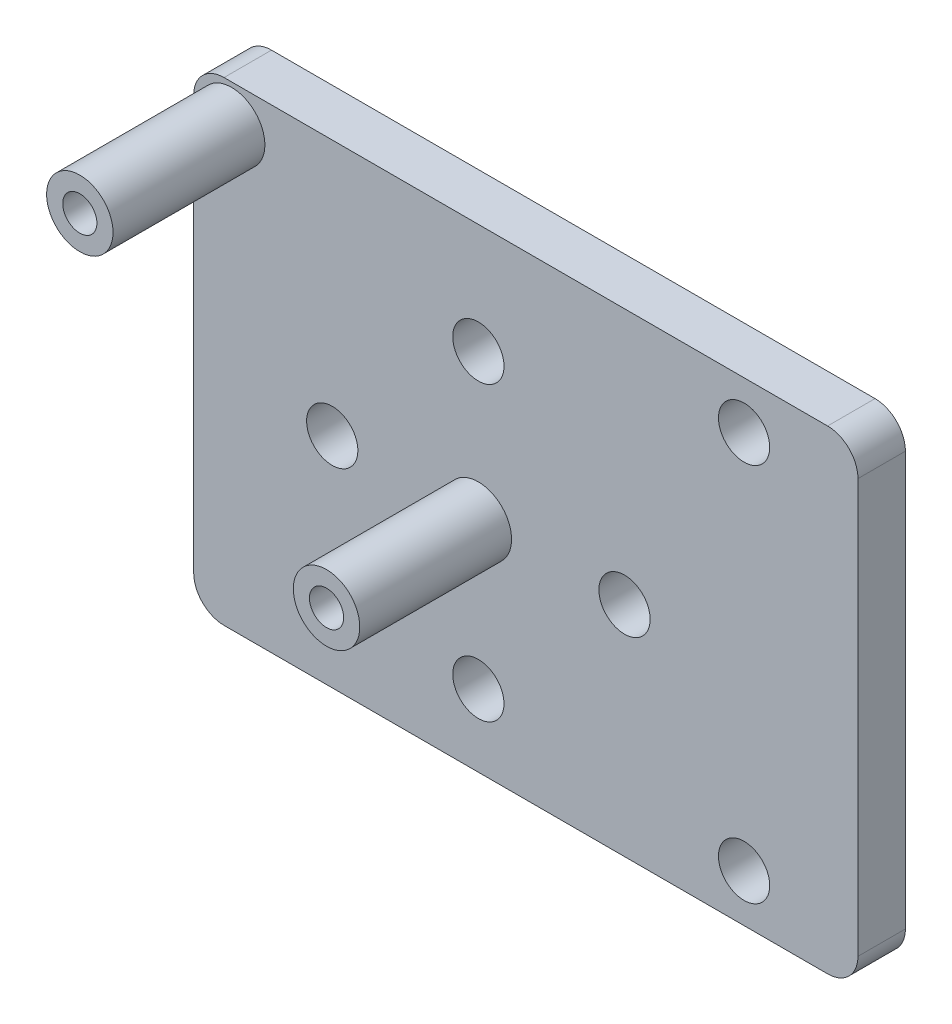
ISO-10303-21;
HEADER;
FILE_DESCRIPTION(('STEP AP214'),'2;1');
FILE_NAME('part.step','',(''),(''),'','','');
FILE_SCHEMA(('AUTOMOTIVE_DESIGN { 1 0 10303 214 1 1 1 1 }'));
ENDSEC;
DATA;
#1=APPLICATION_CONTEXT('core data for automotive mechanical design processes');
#2=APPLICATION_PROTOCOL_DEFINITION('international standard','automotive_design',2000,#1);
#3=PRODUCT_CONTEXT('',#1,'mechanical');
#4=PRODUCT('Part','Part','',(#3));
#5=PRODUCT_RELATED_PRODUCT_CATEGORY('part','',(#4));
#6=PRODUCT_DEFINITION_FORMATION('','',#4);
#7=PRODUCT_DEFINITION_CONTEXT('part definition',#1,'design');
#8=PRODUCT_DEFINITION('design','',#6,#7);
#9=PRODUCT_DEFINITION_SHAPE('','',#8);
#10=(LENGTH_UNIT() NAMED_UNIT(*) SI_UNIT(.MILLI.,.METRE.));
#11=(NAMED_UNIT(*) PLANE_ANGLE_UNIT() SI_UNIT($,.RADIAN.));
#12=(NAMED_UNIT(*) SI_UNIT($,.STERADIAN.) SOLID_ANGLE_UNIT());
#13=UNCERTAINTY_MEASURE_WITH_UNIT(LENGTH_MEASURE(1.E-05),#10,'distance_accuracy_value','');
#14=(GEOMETRIC_REPRESENTATION_CONTEXT(3) GLOBAL_UNCERTAINTY_ASSIGNED_CONTEXT((#13)) GLOBAL_UNIT_ASSIGNED_CONTEXT((#10,
#11,#12)) REPRESENTATION_CONTEXT('',''));
#15=CARTESIAN_POINT('',(0.,0.,0.));
#16=DIRECTION('',(0.,0.,1.));
#17=DIRECTION('',(1.,0.,0.));
#18=AXIS2_PLACEMENT_3D('',#15,#16,#17);
#19=CARTESIAN_POINT('',(0.,0.,3.175));
#20=DIRECTION('',(-1.,0.,0.));
#21=DIRECTION('',(0.,0.,1.));
#22=AXIS2_PLACEMENT_3D('',#19,#20,#21);
#23=PLANE('',#22);
#24=DIRECTION('',(0.,1.,0.));
#25=VECTOR('',#24,1.);
#26=CARTESIAN_POINT('',(0.,0.,0.));
#27=LINE('',#26,#25);
#28=CARTESIAN_POINT('',(0.,-29.718,0.));
#29=VERTEX_POINT('',#28);
#30=CARTESIAN_POINT('',(0.,-2.032,0.));
#31=VERTEX_POINT('',#30);
#32=EDGE_CURVE('E130',#29,#31,#27,.T.);
#33=ORIENTED_EDGE('',*,*,#32,.T.);
#34=DIRECTION('',(0.,0.,-1.));
#35=VECTOR('',#34,1.);
#36=CARTESIAN_POINT('',(0.,-2.032,3.175));
#37=LINE('',#36,#35);
#38=CARTESIAN_POINT('',(0.,-2.032,3.175));
#39=VERTEX_POINT('',#38);
#40=EDGE_CURVE('E11',#31,#39,#37,.F.);
#41=ORIENTED_EDGE('',*,*,#40,.T.);
#42=DIRECTION('',(0.,1.,0.));
#43=VECTOR('',#42,1.);
#44=CARTESIAN_POINT('',(0.,0.,3.175));
#45=LINE('',#44,#43);
#46=CARTESIAN_POINT('',(0.,-29.718,3.175));
#47=VERTEX_POINT('',#46);
#48=EDGE_CURVE('E128',#47,#39,#45,.T.);
#49=ORIENTED_EDGE('',*,*,#48,.F.);
#50=DIRECTION('',(0.,0.,-1.));
#51=VECTOR('',#50,1.);
#52=CARTESIAN_POINT('',(0.,-29.718,3.175));
#53=LINE('',#52,#51);
#54=EDGE_CURVE('E42',#47,#29,#53,.T.);
#55=ORIENTED_EDGE('',*,*,#54,.T.);
#56=EDGE_LOOP('',(#33,#41,#49,#55));
#57=FACE_BOUND('',#56,.T.);
#58=ADVANCED_FACE('F34',(#57),#23,.F.);
#59=CARTESIAN_POINT('',(0.,0.,3.175));
#60=DIRECTION('',(0.,-1.,0.));
#61=DIRECTION('',(1.,0.,0.));
#62=AXIS2_PLACEMENT_3D('',#59,#60,#61);
#63=PLANE('',#62);
#64=DIRECTION('',(-1.,0.,0.));
#65=VECTOR('',#64,1.);
#66=CARTESIAN_POINT('',(0.,0.,0.));
#67=LINE('',#66,#65);
#68=CARTESIAN_POINT('',(-2.032,0.,0.));
#69=VERTEX_POINT('',#68);
#70=CARTESIAN_POINT('',(-42.418,0.,0.));
#71=VERTEX_POINT('',#70);
#72=EDGE_CURVE('E126',#69,#71,#67,.T.);
#73=ORIENTED_EDGE('',*,*,#72,.T.);
#74=DIRECTION('',(0.,0.,-1.));
#75=VECTOR('',#74,1.);
#76=CARTESIAN_POINT('',(-42.418,0.,3.175));
#77=LINE('',#76,#75);
#78=CARTESIAN_POINT('',(-42.418,0.,3.175));
#79=VERTEX_POINT('',#78);
#80=EDGE_CURVE('E105',#71,#79,#77,.F.);
#81=ORIENTED_EDGE('',*,*,#80,.T.);
#82=DIRECTION('',(-1.,0.,0.));
#83=VECTOR('',#82,1.);
#84=CARTESIAN_POINT('',(0.,0.,3.175));
#85=LINE('',#84,#83);
#86=CARTESIAN_POINT('',(-2.032,0.,3.175));
#87=VERTEX_POINT('',#86);
#88=EDGE_CURVE('E199',#87,#79,#85,.T.);
#89=ORIENTED_EDGE('',*,*,#88,.F.);
#90=DIRECTION('',(0.,0.,-1.));
#91=VECTOR('',#90,1.);
#92=CARTESIAN_POINT('',(-2.032,0.,3.175));
#93=LINE('',#92,#91);
#94=EDGE_CURVE('E110',#87,#69,#93,.T.);
#95=ORIENTED_EDGE('',*,*,#94,.T.);
#96=EDGE_LOOP('',(#73,#81,#89,#95));
#97=FACE_BOUND('',#96,.T.);
#98=ADVANCED_FACE('F257',(#97),#63,.F.);
#99=CARTESIAN_POINT('',(-44.45,0.,3.175));
#100=DIRECTION('',(1.,0.,0.));
#101=DIRECTION('',(0.,1.,0.));
#102=AXIS2_PLACEMENT_3D('',#99,#100,#101);
#103=PLANE('',#102);
#104=DIRECTION('',(0.,-1.,0.));
#105=VECTOR('',#104,1.);
#106=CARTESIAN_POINT('',(-44.45,0.,3.175));
#107=LINE('',#106,#105);
#108=CARTESIAN_POINT('',(-44.45,-2.032,3.175));
#109=VERTEX_POINT('',#108);
#110=CARTESIAN_POINT('',(-44.45,-29.718,3.175));
#111=VERTEX_POINT('',#110);
#112=EDGE_CURVE('E119',#109,#111,#107,.T.);
#113=ORIENTED_EDGE('',*,*,#112,.F.);
#114=DIRECTION('',(0.,0.,-1.));
#115=VECTOR('',#114,1.);
#116=CARTESIAN_POINT('',(-44.45,-2.03200000000001,3.175));
#117=LINE('',#116,#115);
#118=CARTESIAN_POINT('',(-44.45,-2.032,0.));
#119=VERTEX_POINT('',#118);
#120=EDGE_CURVE('E104',#109,#119,#117,.T.);
#121=ORIENTED_EDGE('',*,*,#120,.T.);
#122=DIRECTION('',(0.,-1.,0.));
#123=VECTOR('',#122,1.);
#124=CARTESIAN_POINT('',(-44.45,0.,0.));
#125=LINE('',#124,#123);
#126=CARTESIAN_POINT('',(-44.45,-29.718,0.));
#127=VERTEX_POINT('',#126);
#128=EDGE_CURVE('E117',#119,#127,#125,.T.);
#129=ORIENTED_EDGE('',*,*,#128,.T.);
#130=DIRECTION('',(0.,0.,-1.));
#131=VECTOR('',#130,1.);
#132=CARTESIAN_POINT('',(-44.45,-29.718,3.175));
#133=LINE('',#132,#131);
#134=EDGE_CURVE('E121',#127,#111,#133,.F.);
#135=ORIENTED_EDGE('',*,*,#134,.T.);
#136=EDGE_LOOP('',(#113,#121,#129,#135));
#137=FACE_BOUND('',#136,.T.);
#138=ADVANCED_FACE('F116',(#137),#103,.F.);
#139=CARTESIAN_POINT('',(0.,-31.75,3.175));
#140=DIRECTION('',(0.,1.,0.));
#141=DIRECTION('',(-1.,0.,0.));
#142=AXIS2_PLACEMENT_3D('',#139,#140,#141);
#143=PLANE('',#142);
#144=DIRECTION('',(1.,0.,0.));
#145=VECTOR('',#144,1.);
#146=CARTESIAN_POINT('',(0.,-31.75,3.175));
#147=LINE('',#146,#145);
#148=CARTESIAN_POINT('',(-42.418,-31.75,3.175));
#149=VERTEX_POINT('',#148);
#150=CARTESIAN_POINT('',(-2.032,-31.75,3.175));
#151=VERTEX_POINT('',#150);
#152=EDGE_CURVE('E138',#149,#151,#147,.T.);
#153=ORIENTED_EDGE('',*,*,#152,.F.);
#154=DIRECTION('',(0.,0.,-1.));
#155=VECTOR('',#154,1.);
#156=CARTESIAN_POINT('',(-42.418,-31.75,3.175));
#157=LINE('',#156,#155);
#158=CARTESIAN_POINT('',(-42.418,-31.75,0.));
#159=VERTEX_POINT('',#158);
#160=EDGE_CURVE('E180',#149,#159,#157,.T.);
#161=ORIENTED_EDGE('',*,*,#160,.T.);
#162=DIRECTION('',(1.,0.,0.));
#163=VECTOR('',#162,1.);
#164=CARTESIAN_POINT('',(0.,-31.75,0.));
#165=LINE('',#164,#163);
#166=CARTESIAN_POINT('',(-2.032,-31.75,0.));
#167=VERTEX_POINT('',#166);
#168=EDGE_CURVE('E125',#159,#167,#165,.T.);
#169=ORIENTED_EDGE('',*,*,#168,.T.);
#170=DIRECTION('',(0.,0.,-1.));
#171=VECTOR('',#170,1.);
#172=CARTESIAN_POINT('',(-2.032,-31.75,3.175));
#173=LINE('',#172,#171);
#174=EDGE_CURVE('E49',#167,#151,#173,.F.);
#175=ORIENTED_EDGE('',*,*,#174,.T.);
#176=EDGE_LOOP('',(#153,#161,#169,#175));
#177=FACE_BOUND('',#176,.T.);
#178=ADVANCED_FACE('F236',(#177),#143,.F.);
#179=CARTESIAN_POINT('',(0.,0.,3.175));
#180=DIRECTION('',(0.,0.,-1.));
#181=DIRECTION('',(-1.,0.,0.));
#182=AXIS2_PLACEMENT_3D('',#179,#180,#181);
#183=PLANE('',#182);
#184=CARTESIAN_POINT('',(-35.179,-17.145,3.175));
#185=DIRECTION('',(0.,0.,1.));
#186=DIRECTION('',(0.,1.,0.));
#187=AXIS2_PLACEMENT_3D('',#184,#185,#186);
#188=CIRCLE('',#187,1.7145);
#189=CARTESIAN_POINT('',(-35.179,-15.4305,3.175));
#190=VERTEX_POINT('',#189);
#191=EDGE_CURVE('E158',#190,#190,#188,.T.);
#192=ORIENTED_EDGE('',*,*,#191,.F.);
#193=EDGE_LOOP('',(#192));
#194=FACE_BOUND('',#193,.T.);
#195=CARTESIAN_POINT('',(-25.4,-26.924,3.175));
#196=DIRECTION('',(0.,0.,1.));
#197=DIRECTION('',(-1.,0.,0.));
#198=AXIS2_PLACEMENT_3D('',#195,#196,#197);
#199=CIRCLE('',#198,1.7145);
#200=CARTESIAN_POINT('',(-27.1145,-26.924,3.175));
#201=VERTEX_POINT('',#200);
#202=EDGE_CURVE('E225',#201,#201,#199,.T.);
#203=ORIENTED_EDGE('',*,*,#202,.F.);
#204=EDGE_LOOP('',(#203));
#205=FACE_BOUND('',#204,.T.);
#206=CARTESIAN_POINT('',(-15.621,-17.1449999999999,3.175));
#207=DIRECTION('',(0.,0.,1.));
#208=DIRECTION('',(0.,-1.,0.));
#209=AXIS2_PLACEMENT_3D('',#206,#207,#208);
#210=CIRCLE('',#209,1.7145);
#211=CARTESIAN_POINT('',(-15.621,-18.8594999999999,3.175));
#212=VERTEX_POINT('',#211);
#213=EDGE_CURVE('E222',#212,#212,#210,.T.);
#214=ORIENTED_EDGE('',*,*,#213,.F.);
#215=EDGE_LOOP('',(#214));
#216=FACE_BOUND('',#215,.T.);
#217=CARTESIAN_POINT('',(-25.4,-7.366,3.175));
#218=DIRECTION('',(0.,0.,1.));
#219=DIRECTION('',(1.,0.,0.));
#220=AXIS2_PLACEMENT_3D('',#217,#218,#219);
#221=CIRCLE('',#220,1.7145);
#222=CARTESIAN_POINT('',(-23.6855,-7.366,3.175));
#223=VERTEX_POINT('',#222);
#224=EDGE_CURVE('E153',#223,#223,#221,.T.);
#225=ORIENTED_EDGE('',*,*,#224,.F.);
#226=EDGE_LOOP('',(#225));
#227=FACE_BOUND('',#226,.T.);
#228=CARTESIAN_POINT('',(-7.62,-3.17499999999999,3.175));
#229=DIRECTION('',(0.,0.,1.));
#230=DIRECTION('',(1.,0.,0.));
#231=AXIS2_PLACEMENT_3D('',#228,#229,#230);
#232=CIRCLE('',#231,1.7145);
#233=CARTESIAN_POINT('',(-5.9055,-3.17499999999999,3.175));
#234=VERTEX_POINT('',#233);
#235=EDGE_CURVE('E145',#234,#234,#232,.T.);
#236=ORIENTED_EDGE('',*,*,#235,.F.);
#237=EDGE_LOOP('',(#236));
#238=FACE_BOUND('',#237,.T.);
#239=CARTESIAN_POINT('',(-7.62,-28.575,3.175));
#240=DIRECTION('',(0.,0.,1.));
#241=DIRECTION('',(1.,0.,0.));
#242=AXIS2_PLACEMENT_3D('',#239,#240,#241);
#243=CIRCLE('',#242,1.7145);
#244=CARTESIAN_POINT('',(-5.9055,-28.575,3.175));
#245=VERTEX_POINT('',#244);
#246=EDGE_CURVE('E152',#245,#245,#243,.T.);
#247=ORIENTED_EDGE('',*,*,#246,.F.);
#248=EDGE_LOOP('',(#247));
#249=FACE_BOUND('',#248,.T.);
#250=CARTESIAN_POINT('',(-25.4,-17.145,3.175));
#251=DIRECTION('',(0.,0.,-1.));
#252=DIRECTION('',(-1.,0.,0.));
#253=AXIS2_PLACEMENT_3D('',#250,#251,#252);
#254=CIRCLE('',#253,2.2225);
#255=CARTESIAN_POINT('',(-27.6225,-17.145,3.175));
#256=VERTEX_POINT('',#255);
#257=EDGE_CURVE('E137',#256,#256,#254,.F.);
#258=ORIENTED_EDGE('',*,*,#257,.F.);
#259=EDGE_LOOP('',(#258));
#260=FACE_BOUND('',#259,.T.);
#261=CARTESIAN_POINT('',(-41.91,-2.54,3.175));
#262=DIRECTION('',(0.,0.,-1.));
#263=DIRECTION('',(-1.,0.,0.));
#264=AXIS2_PLACEMENT_3D('',#261,#262,#263);
#265=CIRCLE('',#264,2.2225);
#266=CARTESIAN_POINT('',(-44.1325,-2.54,3.175));
#267=VERTEX_POINT('',#266);
#268=EDGE_CURVE('E134',#267,#267,#265,.F.);
#269=ORIENTED_EDGE('',*,*,#268,.F.);
#270=EDGE_LOOP('',(#269));
#271=FACE_BOUND('',#270,.T.);
#272=ORIENTED_EDGE('',*,*,#88,.T.);
#273=CARTESIAN_POINT('',(-42.418,-2.03200000000001,3.175));
#274=DIRECTION('',(0.,0.,-1.));
#275=DIRECTION('',(-1.,0.,0.));
#276=AXIS2_PLACEMENT_3D('',#273,#274,#275);
#277=CIRCLE('',#276,2.032);
#278=EDGE_CURVE('E177',#79,#109,#277,.F.);
#279=ORIENTED_EDGE('',*,*,#278,.T.);
#280=ORIENTED_EDGE('',*,*,#112,.T.);
#281=CARTESIAN_POINT('',(-42.418,-29.718,3.175));
#282=DIRECTION('',(0.,0.,-1.));
#283=DIRECTION('',(-1.,0.,0.));
#284=AXIS2_PLACEMENT_3D('',#281,#282,#283);
#285=CIRCLE('',#284,2.032);
#286=EDGE_CURVE('E56',#111,#149,#285,.F.);
#287=ORIENTED_EDGE('',*,*,#286,.T.);
#288=ORIENTED_EDGE('',*,*,#152,.T.);
#289=CARTESIAN_POINT('',(-2.032,-29.718,3.175));
#290=DIRECTION('',(0.,0.,-1.));
#291=DIRECTION('',(-1.,0.,0.));
#292=AXIS2_PLACEMENT_3D('',#289,#290,#291);
#293=CIRCLE('',#292,2.032);
#294=EDGE_CURVE('E172',#151,#47,#293,.F.);
#295=ORIENTED_EDGE('',*,*,#294,.T.);
#296=ORIENTED_EDGE('',*,*,#48,.T.);
#297=CARTESIAN_POINT('',(-2.032,-2.032,3.175));
#298=DIRECTION('',(0.,0.,-1.));
#299=DIRECTION('',(-1.,0.,0.));
#300=AXIS2_PLACEMENT_3D('',#297,#298,#299);
#301=CIRCLE('',#300,2.032);
#302=EDGE_CURVE('E174',#39,#87,#301,.F.);
#303=ORIENTED_EDGE('',*,*,#302,.T.);
#304=EDGE_LOOP('',(#272,#279,#280,#287,#288,#295,#296,#303));
#305=FACE_BOUND('',#304,.T.);
#306=ADVANCED_FACE('F233',(#194,#205,#216,#227,#238,#249,#260,#271,#305),#183,.F.);
#307=CARTESIAN_POINT('',(0.,0.,0.));
#308=DIRECTION('',(0.,0.,-1.));
#309=DIRECTION('',(-1.,0.,0.));
#310=AXIS2_PLACEMENT_3D('',#307,#308,#309);
#311=PLANE('',#310);
#312=CARTESIAN_POINT('',(-35.179,-17.145,0.));
#313=DIRECTION('',(0.,0.,-1.));
#314=DIRECTION('',(-1.,0.,0.));
#315=AXIS2_PLACEMENT_3D('',#312,#313,#314);
#316=CIRCLE('',#315,1.7145);
#317=CARTESIAN_POINT('',(-36.8935,-17.145,0.));
#318=VERTEX_POINT('',#317);
#319=EDGE_CURVE('E161',#318,#318,#316,.T.);
#320=ORIENTED_EDGE('',*,*,#319,.F.);
#321=EDGE_LOOP('',(#320));
#322=FACE_BOUND('',#321,.T.);
#323=CARTESIAN_POINT('',(-25.4,-26.924,0.));
#324=DIRECTION('',(0.,0.,-1.));
#325=DIRECTION('',(-1.,0.,0.));
#326=AXIS2_PLACEMENT_3D('',#323,#324,#325);
#327=CIRCLE('',#326,1.7145);
#328=CARTESIAN_POINT('',(-27.1145,-26.924,0.));
#329=VERTEX_POINT('',#328);
#330=EDGE_CURVE('E157',#329,#329,#327,.T.);
#331=ORIENTED_EDGE('',*,*,#330,.F.);
#332=EDGE_LOOP('',(#331));
#333=FACE_BOUND('',#332,.T.);
#334=CARTESIAN_POINT('',(-15.621,-17.1449999999999,0.));
#335=DIRECTION('',(0.,0.,-1.));
#336=DIRECTION('',(-1.,0.,0.));
#337=AXIS2_PLACEMENT_3D('',#334,#335,#336);
#338=CIRCLE('',#337,1.7145);
#339=CARTESIAN_POINT('',(-17.3355,-17.1449999999999,0.));
#340=VERTEX_POINT('',#339);
#341=EDGE_CURVE('E154',#340,#340,#338,.T.);
#342=ORIENTED_EDGE('',*,*,#341,.F.);
#343=EDGE_LOOP('',(#342));
#344=FACE_BOUND('',#343,.T.);
#345=CARTESIAN_POINT('',(-25.4,-7.366,0.));
#346=DIRECTION('',(0.,0.,-1.));
#347=DIRECTION('',(-1.,0.,0.));
#348=AXIS2_PLACEMENT_3D('',#345,#346,#347);
#349=CIRCLE('',#348,1.7145);
#350=CARTESIAN_POINT('',(-27.1145,-7.366,0.));
#351=VERTEX_POINT('',#350);
#352=EDGE_CURVE('E149',#351,#351,#349,.T.);
#353=ORIENTED_EDGE('',*,*,#352,.F.);
#354=EDGE_LOOP('',(#353));
#355=FACE_BOUND('',#354,.T.);
#356=CARTESIAN_POINT('',(-7.62,-3.17499999999999,0.));
#357=DIRECTION('',(0.,0.,-1.));
#358=DIRECTION('',(-1.,0.,0.));
#359=AXIS2_PLACEMENT_3D('',#356,#357,#358);
#360=CIRCLE('',#359,1.7145);
#361=CARTESIAN_POINT('',(-9.3345,-3.17499999999999,0.));
#362=VERTEX_POINT('',#361);
#363=EDGE_CURVE('E144',#362,#362,#360,.T.);
#364=ORIENTED_EDGE('',*,*,#363,.F.);
#365=EDGE_LOOP('',(#364));
#366=FACE_BOUND('',#365,.T.);
#367=CARTESIAN_POINT('',(-7.62,-28.575,0.));
#368=DIRECTION('',(0.,0.,-1.));
#369=DIRECTION('',(-1.,0.,0.));
#370=AXIS2_PLACEMENT_3D('',#367,#368,#369);
#371=CIRCLE('',#370,1.7145);
#372=CARTESIAN_POINT('',(-9.3345,-28.575,0.));
#373=VERTEX_POINT('',#372);
#374=EDGE_CURVE('E141',#373,#373,#371,.T.);
#375=ORIENTED_EDGE('',*,*,#374,.F.);
#376=EDGE_LOOP('',(#375));
#377=FACE_BOUND('',#376,.T.);
#378=ORIENTED_EDGE('',*,*,#128,.F.);
#379=CARTESIAN_POINT('',(-42.418,-2.03200000000001,0.));
#380=DIRECTION('',(0.,0.,-1.));
#381=DIRECTION('',(-1.,0.,0.));
#382=AXIS2_PLACEMENT_3D('',#379,#380,#381);
#383=CIRCLE('',#382,2.032);
#384=EDGE_CURVE('E100',#119,#71,#383,.T.);
#385=ORIENTED_EDGE('',*,*,#384,.T.);
#386=ORIENTED_EDGE('',*,*,#72,.F.);
#387=CARTESIAN_POINT('',(-2.032,-2.032,0.));
#388=DIRECTION('',(0.,0.,-1.));
#389=DIRECTION('',(-1.,0.,0.));
#390=AXIS2_PLACEMENT_3D('',#387,#388,#389);
#391=CIRCLE('',#390,2.032);
#392=EDGE_CURVE('E166',#69,#31,#391,.T.);
#393=ORIENTED_EDGE('',*,*,#392,.T.);
#394=ORIENTED_EDGE('',*,*,#32,.F.);
#395=CARTESIAN_POINT('',(-2.032,-29.718,0.));
#396=DIRECTION('',(0.,0.,-1.));
#397=DIRECTION('',(-1.,0.,0.));
#398=AXIS2_PLACEMENT_3D('',#395,#396,#397);
#399=CIRCLE('',#398,2.032);
#400=EDGE_CURVE('E120',#29,#167,#399,.T.);
#401=ORIENTED_EDGE('',*,*,#400,.T.);
#402=ORIENTED_EDGE('',*,*,#168,.F.);
#403=CARTESIAN_POINT('',(-42.418,-29.718,0.));
#404=DIRECTION('',(0.,0.,-1.));
#405=DIRECTION('',(-1.,0.,0.));
#406=AXIS2_PLACEMENT_3D('',#403,#404,#405);
#407=CIRCLE('',#406,2.032);
#408=EDGE_CURVE('E111',#159,#127,#407,.T.);
#409=ORIENTED_EDGE('',*,*,#408,.T.);
#410=EDGE_LOOP('',(#378,#385,#386,#393,#394,#401,#402,#409));
#411=FACE_BOUND('',#410,.T.);
#412=ADVANCED_FACE('F123',(#322,#333,#344,#355,#366,#377,#411),#311,.T.);
#413=CARTESIAN_POINT('',(-41.91,-2.54,13.335));
#414=DIRECTION('',(0.,0.,1.));
#415=DIRECTION('',(1.,0.,0.));
#416=AXIS2_PLACEMENT_3D('',#413,#414,#415);
#417=PLANE('',#416);
#418=CARTESIAN_POINT('',(-41.91,-2.54,13.335));
#419=DIRECTION('',(0.,0.,1.));
#420=DIRECTION('',(1.,0.,0.));
#421=AXIS2_PLACEMENT_3D('',#418,#419,#420);
#422=CIRCLE('',#421,2.2225);
#423=CARTESIAN_POINT('',(-39.6875,-2.54,13.335));
#424=VERTEX_POINT('',#423);
#425=EDGE_CURVE('E192',#424,#424,#422,.T.);
#426=ORIENTED_EDGE('',*,*,#425,.T.);
#427=EDGE_LOOP('',(#426));
#428=FACE_BOUND('',#427,.T.);
#429=CARTESIAN_POINT('',(-41.91,-2.54,13.335));
#430=DIRECTION('',(0.,0.,1.));
#431=DIRECTION('',(1.,0.,0.));
#432=AXIS2_PLACEMENT_3D('',#429,#430,#431);
#433=CIRCLE('',#432,1.143);
#434=CARTESIAN_POINT('',(-40.767,-2.54,13.335));
#435=VERTEX_POINT('',#434);
#436=EDGE_CURVE('E194',#435,#435,#433,.T.);
#437=ORIENTED_EDGE('',*,*,#436,.F.);
#438=EDGE_LOOP('',(#437));
#439=FACE_BOUND('',#438,.T.);
#440=ADVANCED_FACE('F287',(#428,#439),#417,.T.);
#441=CARTESIAN_POINT('',(-41.91,-2.54,13.335));
#442=DIRECTION('',(0.,0.,-1.));
#443=DIRECTION('',(-1.,0.,0.));
#444=AXIS2_PLACEMENT_3D('',#441,#442,#443);
#445=CYLINDRICAL_SURFACE('',#444,2.2225);
#446=ORIENTED_EDGE('',*,*,#425,.F.);
#447=EDGE_LOOP('',(#446));
#448=FACE_BOUND('',#447,.T.);
#449=ORIENTED_EDGE('',*,*,#268,.T.);
#450=EDGE_LOOP('',(#449));
#451=FACE_BOUND('',#450,.T.);
#452=ADVANCED_FACE('F290',(#448,#451),#445,.T.);
#453=CARTESIAN_POINT('',(-41.91,-2.54,13.335));
#454=DIRECTION('',(0.,0.,-1.));
#455=DIRECTION('',(-1.,0.,0.));
#456=AXIS2_PLACEMENT_3D('',#453,#454,#455);
#457=CYLINDRICAL_SURFACE('',#456,1.143);
#458=ORIENTED_EDGE('',*,*,#436,.T.);
#459=EDGE_LOOP('',(#458));
#460=FACE_BOUND('',#459,.T.);
#461=CARTESIAN_POINT('',(-41.91,-2.54,3.175));
#462=DIRECTION('',(0.,0.,1.));
#463=DIRECTION('',(1.,0.,0.));
#464=AXIS2_PLACEMENT_3D('',#461,#462,#463);
#465=CIRCLE('',#464,1.143);
#466=CARTESIAN_POINT('',(-40.767,-2.54,3.175));
#467=VERTEX_POINT('',#466);
#468=EDGE_CURVE('E203',#467,#467,#465,.T.);
#469=ORIENTED_EDGE('',*,*,#468,.F.);
#470=EDGE_LOOP('',(#469));
#471=FACE_BOUND('',#470,.T.);
#472=ADVANCED_FACE('F293',(#460,#471),#457,.F.);
#473=ORIENTED_EDGE('',*,*,#468,.T.);
#474=EDGE_LOOP('',(#473));
#475=FACE_BOUND('',#474,.T.);
#476=ADVANCED_FACE('F239',(#475),#183,.F.);
#477=CARTESIAN_POINT('',(-25.4,-17.145,13.335));
#478=DIRECTION('',(0.,0.,1.));
#479=DIRECTION('',(1.,0.,0.));
#480=AXIS2_PLACEMENT_3D('',#477,#478,#479);
#481=PLANE('',#480);
#482=CARTESIAN_POINT('',(-25.4,-17.145,13.335));
#483=DIRECTION('',(0.,0.,1.));
#484=DIRECTION('',(1.,0.,0.));
#485=AXIS2_PLACEMENT_3D('',#482,#483,#484);
#486=CIRCLE('',#485,2.2225);
#487=CARTESIAN_POINT('',(-23.1775,-17.145,13.335));
#488=VERTEX_POINT('',#487);
#489=EDGE_CURVE('E206',#488,#488,#486,.T.);
#490=ORIENTED_EDGE('',*,*,#489,.T.);
#491=EDGE_LOOP('',(#490));
#492=FACE_BOUND('',#491,.T.);
#493=CARTESIAN_POINT('',(-25.4,-17.145,13.335));
#494=DIRECTION('',(0.,0.,1.));
#495=DIRECTION('',(1.,0.,0.));
#496=AXIS2_PLACEMENT_3D('',#493,#494,#495);
#497=CIRCLE('',#496,1.143);
#498=CARTESIAN_POINT('',(-24.257,-17.145,13.335));
#499=VERTEX_POINT('',#498);
#500=EDGE_CURVE('E211',#499,#499,#497,.T.);
#501=ORIENTED_EDGE('',*,*,#500,.F.);
#502=EDGE_LOOP('',(#501));
#503=FACE_BOUND('',#502,.T.);
#504=ADVANCED_FACE('F305',(#492,#503),#481,.T.);
#505=CARTESIAN_POINT('',(-25.4,-17.145,13.335));
#506=DIRECTION('',(0.,0.,-1.));
#507=DIRECTION('',(-1.,0.,0.));
#508=AXIS2_PLACEMENT_3D('',#505,#506,#507);
#509=CYLINDRICAL_SURFACE('',#508,2.2225);
#510=ORIENTED_EDGE('',*,*,#489,.F.);
#511=EDGE_LOOP('',(#510));
#512=FACE_BOUND('',#511,.T.);
#513=ORIENTED_EDGE('',*,*,#257,.T.);
#514=EDGE_LOOP('',(#513));
#515=FACE_BOUND('',#514,.T.);
#516=ADVANCED_FACE('F301',(#512,#515),#509,.T.);
#517=CARTESIAN_POINT('',(-25.4,-17.145,13.335));
#518=DIRECTION('',(0.,0.,-1.));
#519=DIRECTION('',(-1.,0.,0.));
#520=AXIS2_PLACEMENT_3D('',#517,#518,#519);
#521=CYLINDRICAL_SURFACE('',#520,1.143);
#522=ORIENTED_EDGE('',*,*,#500,.T.);
#523=EDGE_LOOP('',(#522));
#524=FACE_BOUND('',#523,.T.);
#525=CARTESIAN_POINT('',(-25.4,-17.145,3.175));
#526=DIRECTION('',(0.,0.,1.));
#527=DIRECTION('',(1.,0.,0.));
#528=AXIS2_PLACEMENT_3D('',#525,#526,#527);
#529=CIRCLE('',#528,1.143);
#530=CARTESIAN_POINT('',(-24.257,-17.145,3.175));
#531=VERTEX_POINT('',#530);
#532=EDGE_CURVE('E148',#531,#531,#529,.T.);
#533=ORIENTED_EDGE('',*,*,#532,.F.);
#534=EDGE_LOOP('',(#533));
#535=FACE_BOUND('',#534,.T.);
#536=ADVANCED_FACE('F304',(#524,#535),#521,.F.);
#537=ORIENTED_EDGE('',*,*,#532,.T.);
#538=EDGE_LOOP('',(#537));
#539=FACE_BOUND('',#538,.T.);
#540=ADVANCED_FACE('F238',(#539),#183,.F.);
#541=CARTESIAN_POINT('',(-7.62,-28.575,-9.525));
#542=DIRECTION('',(0.,0.,1.));
#543=DIRECTION('',(1.,0.,0.));
#544=AXIS2_PLACEMENT_3D('',#541,#542,#543);
#545=CYLINDRICAL_SURFACE('',#544,1.7145);
#546=ORIENTED_EDGE('',*,*,#374,.T.);
#547=EDGE_LOOP('',(#546));
#548=FACE_BOUND('',#547,.T.);
#549=ORIENTED_EDGE('',*,*,#246,.T.);
#550=EDGE_LOOP('',(#549));
#551=FACE_BOUND('',#550,.T.);
#552=ADVANCED_FACE('F313',(#548,#551),#545,.F.);
#553=CARTESIAN_POINT('',(-7.62,-3.17499999999999,-9.525));
#554=DIRECTION('',(0.,0.,1.));
#555=DIRECTION('',(1.,0.,0.));
#556=AXIS2_PLACEMENT_3D('',#553,#554,#555);
#557=CYLINDRICAL_SURFACE('',#556,1.7145);
#558=ORIENTED_EDGE('',*,*,#363,.T.);
#559=EDGE_LOOP('',(#558));
#560=FACE_BOUND('',#559,.T.);
#561=ORIENTED_EDGE('',*,*,#235,.T.);
#562=EDGE_LOOP('',(#561));
#563=FACE_BOUND('',#562,.T.);
#564=ADVANCED_FACE('F316',(#560,#563),#557,.F.);
#565=CARTESIAN_POINT('',(-25.4,-7.366,-9.525));
#566=DIRECTION('',(0.,0.,1.));
#567=DIRECTION('',(1.,0.,0.));
#568=AXIS2_PLACEMENT_3D('',#565,#566,#567);
#569=CYLINDRICAL_SURFACE('',#568,1.7145);
#570=ORIENTED_EDGE('',*,*,#352,.T.);
#571=EDGE_LOOP('',(#570));
#572=FACE_BOUND('',#571,.T.);
#573=ORIENTED_EDGE('',*,*,#224,.T.);
#574=EDGE_LOOP('',(#573));
#575=FACE_BOUND('',#574,.T.);
#576=ADVANCED_FACE('F320',(#572,#575),#569,.F.);
#577=CARTESIAN_POINT('',(-15.621,-17.1449999999999,-9.525));
#578=DIRECTION('',(0.,0.,1.));
#579=DIRECTION('',(1.,0.,0.));
#580=AXIS2_PLACEMENT_3D('',#577,#578,#579);
#581=CYLINDRICAL_SURFACE('',#580,1.7145);
#582=ORIENTED_EDGE('',*,*,#341,.T.);
#583=EDGE_LOOP('',(#582));
#584=FACE_BOUND('',#583,.T.);
#585=ORIENTED_EDGE('',*,*,#213,.T.);
#586=EDGE_LOOP('',(#585));
#587=FACE_BOUND('',#586,.T.);
#588=ADVANCED_FACE('F324',(#584,#587),#581,.F.);
#589=CARTESIAN_POINT('',(-25.4,-26.924,-9.525));
#590=DIRECTION('',(0.,0.,1.));
#591=DIRECTION('',(1.,0.,0.));
#592=AXIS2_PLACEMENT_3D('',#589,#590,#591);
#593=CYLINDRICAL_SURFACE('',#592,1.7145);
#594=ORIENTED_EDGE('',*,*,#330,.T.);
#595=EDGE_LOOP('',(#594));
#596=FACE_BOUND('',#595,.T.);
#597=ORIENTED_EDGE('',*,*,#202,.T.);
#598=EDGE_LOOP('',(#597));
#599=FACE_BOUND('',#598,.T.);
#600=ADVANCED_FACE('F328',(#596,#599),#593,.F.);
#601=CARTESIAN_POINT('',(-35.179,-17.145,-9.525));
#602=DIRECTION('',(0.,0.,1.));
#603=DIRECTION('',(1.,0.,0.));
#604=AXIS2_PLACEMENT_3D('',#601,#602,#603);
#605=CYLINDRICAL_SURFACE('',#604,1.7145);
#606=ORIENTED_EDGE('',*,*,#319,.T.);
#607=EDGE_LOOP('',(#606));
#608=FACE_BOUND('',#607,.T.);
#609=ORIENTED_EDGE('',*,*,#191,.T.);
#610=EDGE_LOOP('',(#609));
#611=FACE_BOUND('',#610,.T.);
#612=ADVANCED_FACE('F231',(#608,#611),#605,.F.);
#613=CARTESIAN_POINT('',(-42.418,-2.03200000000001,3.175));
#614=DIRECTION('',(0.,0.,-1.));
#615=DIRECTION('',(-1.,0.,0.));
#616=AXIS2_PLACEMENT_3D('',#613,#614,#615);
#617=CYLINDRICAL_SURFACE('',#616,2.032);
#618=ORIENTED_EDGE('',*,*,#278,.F.);
#619=ORIENTED_EDGE('',*,*,#80,.F.);
#620=ORIENTED_EDGE('',*,*,#384,.F.);
#621=ORIENTED_EDGE('',*,*,#120,.F.);
#622=EDGE_LOOP('',(#618,#619,#620,#621));
#623=FACE_BOUND('',#622,.T.);
#624=ADVANCED_FACE('F103',(#623),#617,.T.);
#625=CARTESIAN_POINT('',(-42.418,-29.718,3.175));
#626=DIRECTION('',(0.,0.,-1.));
#627=DIRECTION('',(-1.,0.,0.));
#628=AXIS2_PLACEMENT_3D('',#625,#626,#627);
#629=CYLINDRICAL_SURFACE('',#628,2.032);
#630=ORIENTED_EDGE('',*,*,#286,.F.);
#631=ORIENTED_EDGE('',*,*,#134,.F.);
#632=ORIENTED_EDGE('',*,*,#408,.F.);
#633=ORIENTED_EDGE('',*,*,#160,.F.);
#634=EDGE_LOOP('',(#630,#631,#632,#633));
#635=FACE_BOUND('',#634,.T.);
#636=ADVANCED_FACE('F264',(#635),#629,.T.);
#637=CARTESIAN_POINT('',(-2.032,-2.032,3.175));
#638=DIRECTION('',(0.,0.,-1.));
#639=DIRECTION('',(-1.,0.,0.));
#640=AXIS2_PLACEMENT_3D('',#637,#638,#639);
#641=CYLINDRICAL_SURFACE('',#640,2.032);
#642=ORIENTED_EDGE('',*,*,#302,.F.);
#643=ORIENTED_EDGE('',*,*,#40,.F.);
#644=ORIENTED_EDGE('',*,*,#392,.F.);
#645=ORIENTED_EDGE('',*,*,#94,.F.);
#646=EDGE_LOOP('',(#642,#643,#644,#645));
#647=FACE_BOUND('',#646,.T.);
#648=ADVANCED_FACE('F259',(#647),#641,.T.);
#649=CARTESIAN_POINT('',(-2.032,-29.718,3.175));
#650=DIRECTION('',(0.,0.,-1.));
#651=DIRECTION('',(-1.,0.,0.));
#652=AXIS2_PLACEMENT_3D('',#649,#650,#651);
#653=CYLINDRICAL_SURFACE('',#652,2.032);
#654=ORIENTED_EDGE('',*,*,#294,.F.);
#655=ORIENTED_EDGE('',*,*,#174,.F.);
#656=ORIENTED_EDGE('',*,*,#400,.F.);
#657=ORIENTED_EDGE('',*,*,#54,.F.);
#658=EDGE_LOOP('',(#654,#655,#656,#657));
#659=FACE_BOUND('',#658,.T.);
#660=ADVANCED_FACE('F36',(#659),#653,.T.);
#661=CLOSED_SHELL('',(#58,#98,#138,#178,#306,#412,#440,#452,#472,#476,#504,#516,#536,#540,#552,
#564,#576,#588,#600,#612,#624,#636,#648,#660));
#662=MANIFOLD_SOLID_BREP('B2',#661);
#663=ADVANCED_BREP_SHAPE_REPRESENTATION('',(#18,#662),#14);
#664=SHAPE_DEFINITION_REPRESENTATION(#9,#663);
ENDSEC;
END-ISO-10303-21;
